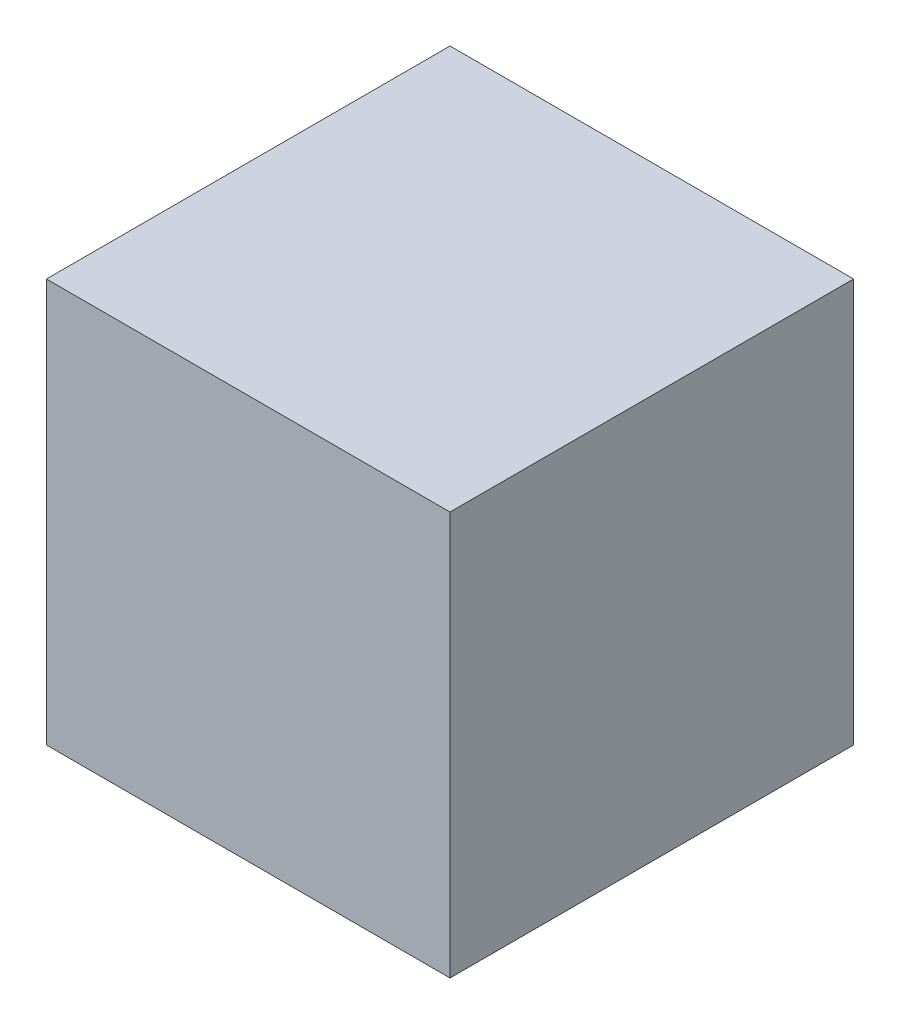
ISO-10303-21;
HEADER;
FILE_DESCRIPTION(('STEP AP214'),'2;1');
FILE_NAME('part.step','',(''),(''),'','','');
FILE_SCHEMA(('AUTOMOTIVE_DESIGN { 1 0 10303 214 1 1 1 1 }'));
ENDSEC;
DATA;
#1=APPLICATION_CONTEXT('core data for automotive mechanical design processes');
#2=APPLICATION_PROTOCOL_DEFINITION('international standard','automotive_design',2000,#1);
#3=PRODUCT_CONTEXT('',#1,'mechanical');
#4=PRODUCT('Part','Part','',(#3));
#5=PRODUCT_RELATED_PRODUCT_CATEGORY('part','',(#4));
#6=PRODUCT_DEFINITION_FORMATION('','',#4);
#7=PRODUCT_DEFINITION_CONTEXT('part definition',#1,'design');
#8=PRODUCT_DEFINITION('design','',#6,#7);
#9=PRODUCT_DEFINITION_SHAPE('','',#8);
#10=(LENGTH_UNIT() NAMED_UNIT(*) SI_UNIT(.MILLI.,.METRE.));
#11=(NAMED_UNIT(*) PLANE_ANGLE_UNIT() SI_UNIT($,.RADIAN.));
#12=(NAMED_UNIT(*) SI_UNIT($,.STERADIAN.) SOLID_ANGLE_UNIT());
#13=UNCERTAINTY_MEASURE_WITH_UNIT(LENGTH_MEASURE(1.E-05),#10,'distance_accuracy_value','');
#14=(GEOMETRIC_REPRESENTATION_CONTEXT(3) GLOBAL_UNCERTAINTY_ASSIGNED_CONTEXT((#13)) GLOBAL_UNIT_ASSIGNED_CONTEXT((#10,
#11,#12)) REPRESENTATION_CONTEXT('',''));
#15=CARTESIAN_POINT('',(0.,0.,0.));
#16=DIRECTION('',(0.,0.,1.));
#17=DIRECTION('',(1.,0.,0.));
#18=AXIS2_PLACEMENT_3D('',#15,#16,#17);
#19=CARTESIAN_POINT('',(-228.6,457.2,228.6));
#20=DIRECTION('',(0.,-1.,0.));
#21=DIRECTION('',(0.,0.,-1.));
#22=AXIS2_PLACEMENT_3D('',#19,#20,#21);
#23=PLANE('',#22);
#24=DIRECTION('',(1.,0.,0.));
#25=VECTOR('',#24,1.);
#26=CARTESIAN_POINT('',(0.,457.2,228.6));
#27=LINE('',#26,#25);
#28=CARTESIAN_POINT('',(-228.6,457.2,228.6));
#29=VERTEX_POINT('',#28);
#30=CARTESIAN_POINT('',(228.6,457.2,228.6));
#31=VERTEX_POINT('',#30);
#32=EDGE_CURVE('E69',#29,#31,#27,.T.);
#33=ORIENTED_EDGE('',*,*,#32,.T.);
#34=DIRECTION('',(0.,0.,-1.));
#35=VECTOR('',#34,1.);
#36=CARTESIAN_POINT('',(228.6,457.2,0.));
#37=LINE('',#36,#35);
#38=CARTESIAN_POINT('',(228.6,457.2,-228.6));
#39=VERTEX_POINT('',#38);
#40=EDGE_CURVE('E56',#31,#39,#37,.T.);
#41=ORIENTED_EDGE('',*,*,#40,.T.);
#42=DIRECTION('',(-1.,0.,0.));
#43=VECTOR('',#42,1.);
#44=CARTESIAN_POINT('',(0.,457.2,-228.6));
#45=LINE('',#44,#43);
#46=CARTESIAN_POINT('',(-228.6,457.2,-228.6));
#47=VERTEX_POINT('',#46);
#48=EDGE_CURVE('E21',#39,#47,#45,.T.);
#49=ORIENTED_EDGE('',*,*,#48,.T.);
#50=DIRECTION('',(0.,0.,1.));
#51=VECTOR('',#50,1.);
#52=CARTESIAN_POINT('',(-228.6,457.2,0.));
#53=LINE('',#52,#51);
#54=EDGE_CURVE('E82',#47,#29,#53,.T.);
#55=ORIENTED_EDGE('',*,*,#54,.T.);
#56=EDGE_LOOP('',(#33,#41,#49,#55));
#57=FACE_BOUND('',#56,.T.);
#58=ADVANCED_FACE('F17',(#57),#23,.F.);
#59=CARTESIAN_POINT('',(-228.6,0.,-228.6));
#60=DIRECTION('',(0.,0.,1.));
#61=DIRECTION('',(1.,0.,0.));
#62=AXIS2_PLACEMENT_3D('',#59,#60,#61);
#63=PLANE('',#62);
#64=DIRECTION('',(0.,-1.,0.));
#65=VECTOR('',#64,1.);
#66=CARTESIAN_POINT('',(228.6,228.6,-228.6));
#67=LINE('',#66,#65);
#68=CARTESIAN_POINT('',(228.6,0.,-228.6));
#69=VERTEX_POINT('',#68);
#70=EDGE_CURVE('E62',#39,#69,#67,.T.);
#71=ORIENTED_EDGE('',*,*,#70,.T.);
#72=DIRECTION('',(1.,0.,0.));
#73=VECTOR('',#72,1.);
#74=CARTESIAN_POINT('',(0.,0.,-228.6));
#75=LINE('',#74,#73);
#76=CARTESIAN_POINT('',(-228.6,0.,-228.6));
#77=VERTEX_POINT('',#76);
#78=EDGE_CURVE('E84',#77,#69,#75,.T.);
#79=ORIENTED_EDGE('',*,*,#78,.F.);
#80=DIRECTION('',(0.,1.,0.));
#81=VECTOR('',#80,1.);
#82=CARTESIAN_POINT('',(-228.6,228.6,-228.6));
#83=LINE('',#82,#81);
#84=EDGE_CURVE('E65',#77,#47,#83,.T.);
#85=ORIENTED_EDGE('',*,*,#84,.T.);
#86=ORIENTED_EDGE('',*,*,#48,.F.);
#87=EDGE_LOOP('',(#71,#79,#85,#86));
#88=FACE_BOUND('',#87,.T.);
#89=ADVANCED_FACE('F61',(#88),#63,.F.);
#90=CARTESIAN_POINT('',(228.6,0.,-228.6));
#91=DIRECTION('',(-1.,0.,0.));
#92=DIRECTION('',(0.,0.,1.));
#93=AXIS2_PLACEMENT_3D('',#90,#91,#92);
#94=PLANE('',#93);
#95=DIRECTION('',(0.,-1.,0.));
#96=VECTOR('',#95,1.);
#97=CARTESIAN_POINT('',(228.6,228.6,228.6));
#98=LINE('',#97,#96);
#99=CARTESIAN_POINT('',(228.6,0.,228.6));
#100=VERTEX_POINT('',#99);
#101=EDGE_CURVE('E71',#31,#100,#98,.T.);
#102=ORIENTED_EDGE('',*,*,#101,.T.);
#103=DIRECTION('',(0.,0.,1.));
#104=VECTOR('',#103,1.);
#105=CARTESIAN_POINT('',(228.6,0.,0.));
#106=LINE('',#105,#104);
#107=EDGE_CURVE('E75',#69,#100,#106,.T.);
#108=ORIENTED_EDGE('',*,*,#107,.F.);
#109=ORIENTED_EDGE('',*,*,#70,.F.);
#110=ORIENTED_EDGE('',*,*,#40,.F.);
#111=EDGE_LOOP('',(#102,#108,#109,#110));
#112=FACE_BOUND('',#111,.T.);
#113=ADVANCED_FACE('F73',(#112),#94,.F.);
#114=CARTESIAN_POINT('',(228.6,0.,228.6));
#115=DIRECTION('',(0.,0.,-1.));
#116=DIRECTION('',(-1.,0.,0.));
#117=AXIS2_PLACEMENT_3D('',#114,#115,#116);
#118=PLANE('',#117);
#119=DIRECTION('',(0.,-1.,0.));
#120=VECTOR('',#119,1.);
#121=CARTESIAN_POINT('',(-228.6,228.6,228.6));
#122=LINE('',#121,#120);
#123=CARTESIAN_POINT('',(-228.6,0.,228.6));
#124=VERTEX_POINT('',#123);
#125=EDGE_CURVE('E36',#29,#124,#122,.T.);
#126=ORIENTED_EDGE('',*,*,#125,.T.);
#127=DIRECTION('',(-1.,0.,0.));
#128=VECTOR('',#127,1.);
#129=CARTESIAN_POINT('',(0.,0.,228.6));
#130=LINE('',#129,#128);
#131=EDGE_CURVE('E27',#100,#124,#130,.T.);
#132=ORIENTED_EDGE('',*,*,#131,.F.);
#133=ORIENTED_EDGE('',*,*,#101,.F.);
#134=ORIENTED_EDGE('',*,*,#32,.F.);
#135=EDGE_LOOP('',(#126,#132,#133,#134));
#136=FACE_BOUND('',#135,.T.);
#137=ADVANCED_FACE('F89',(#136),#118,.F.);
#138=CARTESIAN_POINT('',(-228.6,0.,228.6));
#139=DIRECTION('',(1.,0.,0.));
#140=DIRECTION('',(0.,0.,-1.));
#141=AXIS2_PLACEMENT_3D('',#138,#139,#140);
#142=PLANE('',#141);
#143=ORIENTED_EDGE('',*,*,#84,.F.);
#144=DIRECTION('',(0.,0.,-1.));
#145=VECTOR('',#144,1.);
#146=CARTESIAN_POINT('',(-228.6,0.,0.));
#147=LINE('',#146,#145);
#148=EDGE_CURVE('E11',#124,#77,#147,.T.);
#149=ORIENTED_EDGE('',*,*,#148,.F.);
#150=ORIENTED_EDGE('',*,*,#125,.F.);
#151=ORIENTED_EDGE('',*,*,#54,.F.);
#152=EDGE_LOOP('',(#143,#149,#150,#151));
#153=FACE_BOUND('',#152,.T.);
#154=ADVANCED_FACE('F91',(#153),#142,.F.);
#155=CARTESIAN_POINT('',(-228.6,0.,228.6));
#156=DIRECTION('',(0.,-1.,0.));
#157=DIRECTION('',(0.,0.,-1.));
#158=AXIS2_PLACEMENT_3D('',#155,#156,#157);
#159=PLANE('',#158);
#160=ORIENTED_EDGE('',*,*,#131,.T.);
#161=ORIENTED_EDGE('',*,*,#148,.T.);
#162=ORIENTED_EDGE('',*,*,#78,.T.);
#163=ORIENTED_EDGE('',*,*,#107,.T.);
#164=EDGE_LOOP('',(#160,#161,#162,#163));
#165=FACE_BOUND('',#164,.T.);
#166=ADVANCED_FACE('F19',(#165),#159,.T.);
#167=CLOSED_SHELL('',(#58,#89,#113,#137,#154,#166));
#168=MANIFOLD_SOLID_BREP('B1',#167);
#169=ADVANCED_BREP_SHAPE_REPRESENTATION('',(#18,#168),#14);
#170=SHAPE_DEFINITION_REPRESENTATION(#9,#169);
ENDSEC;
END-ISO-10303-21;
